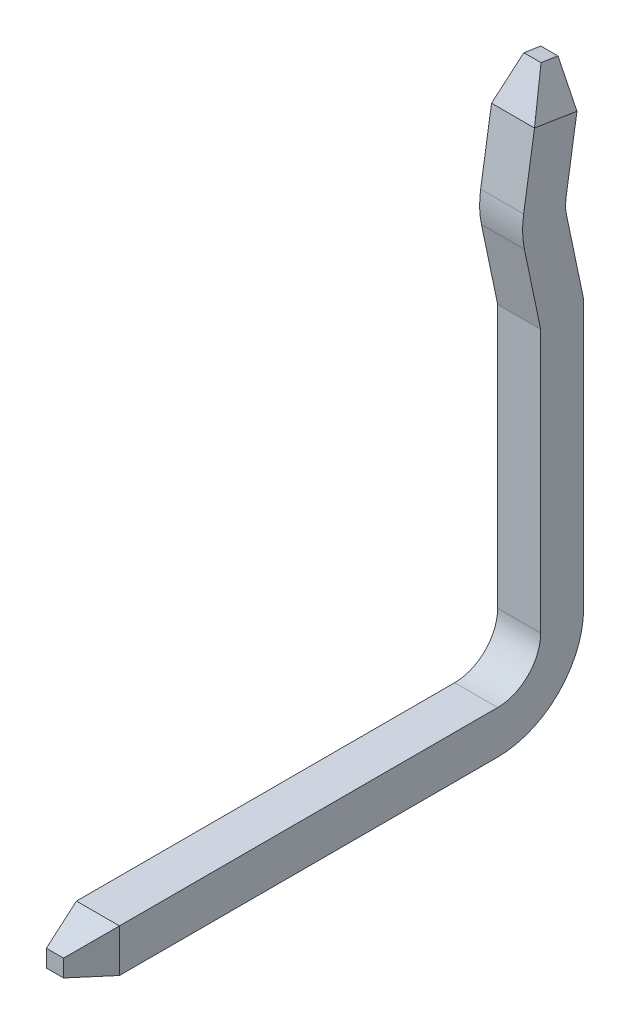
ISO-10303-21;
HEADER;
FILE_DESCRIPTION(('STEP AP214'),'2;1');
FILE_NAME('part.step','',(''),(''),'','','');
FILE_SCHEMA(('AUTOMOTIVE_DESIGN { 1 0 10303 214 1 1 1 1 }'));
ENDSEC;
DATA;
#1=APPLICATION_CONTEXT('core data for automotive mechanical design processes');
#2=APPLICATION_PROTOCOL_DEFINITION('international standard','automotive_design',2000,#1);
#3=PRODUCT_CONTEXT('',#1,'mechanical');
#4=PRODUCT('Part','Part','',(#3));
#5=PRODUCT_RELATED_PRODUCT_CATEGORY('part','',(#4));
#6=PRODUCT_DEFINITION_FORMATION('','',#4);
#7=PRODUCT_DEFINITION_CONTEXT('part definition',#1,'design');
#8=PRODUCT_DEFINITION('design','',#6,#7);
#9=PRODUCT_DEFINITION_SHAPE('','',#8);
#10=(LENGTH_UNIT() NAMED_UNIT(*) SI_UNIT(.MILLI.,.METRE.));
#11=(NAMED_UNIT(*) PLANE_ANGLE_UNIT() SI_UNIT($,.RADIAN.));
#12=(NAMED_UNIT(*) SI_UNIT($,.STERADIAN.) SOLID_ANGLE_UNIT());
#13=UNCERTAINTY_MEASURE_WITH_UNIT(LENGTH_MEASURE(1.E-05),#10,'distance_accuracy_value','');
#14=(GEOMETRIC_REPRESENTATION_CONTEXT(3) GLOBAL_UNCERTAINTY_ASSIGNED_CONTEXT((#13)) GLOBAL_UNIT_ASSIGNED_CONTEXT((#10,
#11,#12)) REPRESENTATION_CONTEXT('',''));
#15=CARTESIAN_POINT('',(0.,0.,0.));
#16=DIRECTION('',(0.,0.,1.));
#17=DIRECTION('',(1.,0.,0.));
#18=AXIS2_PLACEMENT_3D('',#15,#16,#17);
#19=CARTESIAN_POINT('',(0.25,-1.545,1.95));
#20=DIRECTION('',(0.957826285221234,0.,0.28734788556607));
#21=DIRECTION('',(0.28734788556607,0.,-0.957826285221234));
#22=AXIS2_PLACEMENT_3D('',#19,#20,#21);
#23=PLANE('',#22);
#24=DIRECTION('',(-0.276172385369497,-0.276172385369232,0.920574617898403));
#25=VECTOR('',#24,1.);
#26=CARTESIAN_POINT('',(0.25,-2.04500000000014,1.94999999999996));
#27=LINE('',#26,#25);
#28=CARTESIAN_POINT('',(0.25,-2.04500000000004,1.94999999999999));
#29=VERTEX_POINT('',#28);
#30=CARTESIAN_POINT('',(0.1,-2.195,2.45));
#31=VERTEX_POINT('',#30);
#32=EDGE_CURVE('E199',#29,#31,#27,.T.);
#33=ORIENTED_EDGE('',*,*,#32,.T.);
#34=DIRECTION('',(0.,1.,0.));
#35=VECTOR('',#34,1.);
#36=CARTESIAN_POINT('',(0.1,-2.545,2.45));
#37=LINE('',#36,#35);
#38=CARTESIAN_POINT('',(0.1,-2.3950000000001,2.45000000000003));
#39=VERTEX_POINT('',#38);
#40=EDGE_CURVE('E186',#31,#39,#37,.F.);
#41=ORIENTED_EDGE('',*,*,#40,.T.);
#42=DIRECTION('',(0.276172385369497,-0.276172385369232,-0.920574617898403));
#43=VECTOR('',#42,1.);
#44=CARTESIAN_POINT('',(0.1,-2.39500000000014,2.45000000000004));
#45=LINE('',#44,#43);
#46=CARTESIAN_POINT('',(0.25,-2.545,1.95));
#47=VERTEX_POINT('',#46);
#48=EDGE_CURVE('E176',#39,#47,#45,.T.);
#49=ORIENTED_EDGE('',*,*,#48,.T.);
#50=DIRECTION('',(0.,1.,0.));
#51=VECTOR('',#50,1.);
#52=CARTESIAN_POINT('',(0.25,-1.545,1.95));
#53=LINE('',#52,#51);
#54=EDGE_CURVE('E174',#29,#47,#53,.F.);
#55=ORIENTED_EDGE('',*,*,#54,.F.);
#56=EDGE_LOOP('',(#33,#41,#49,#55));
#57=FACE_BOUND('',#56,.T.);
#58=ADVANCED_FACE('F17',(#57),#23,.T.);
#59=CARTESIAN_POINT('',(0.25,3.520833156617,-3.246655096118));
#60=DIRECTION('',(0.957826285221184,0.283859283231054,-0.0446398326939085));
#61=DIRECTION('',(-0.284142531904714,0.95878205112673,0.));
#62=AXIS2_PLACEMENT_3D('',#59,#60,#61);
#63=PLANE('',#62);
#64=DIRECTION('',(-0.276172385369324,0.952301910054694,0.129807109457069));
#65=VECTOR('',#64,1.);
#66=CARTESIAN_POINT('',(0.25,3.50107034627793,-3.37232441069451));
#67=LINE('',#66,#65);
#68=CARTESIAN_POINT('',(0.250000000000004,3.50107034627795,-3.37232441069499));
#69=VERTEX_POINT('',#68);
#70=CARTESIAN_POINT('',(0.1,4.01830267679186,-3.30182110388298));
#71=VERTEX_POINT('',#70);
#72=EDGE_CURVE('E242',#69,#71,#67,.T.);
#73=ORIENTED_EDGE('',*,*,#72,.T.);
#74=DIRECTION('',(0.,-0.155351178610058,-0.987859307444368));
#75=VECTOR('',#74,1.);
#76=CARTESIAN_POINT('',(0.1,4.072675589305,-2.956070346278));
#77=LINE('',#76,#75);
#78=CARTESIAN_POINT('',(0.0999999999999999,4.04937291251366,-3.10424924239441));
#79=VERTEX_POINT('',#78);
#80=EDGE_CURVE('E243',#71,#79,#77,.F.);
#81=ORIENTED_EDGE('',*,*,#80,.T.);
#82=DIRECTION('',(0.276172385369499,-0.866494498921235,0.415831813235302));
#83=VECTOR('',#82,1.);
#84=CARTESIAN_POINT('',(0.0999999999999999,4.04937291251369,-3.10424924239464));
#85=LINE('',#84,#83);
#86=CARTESIAN_POINT('',(0.25,3.57874593558309,-2.87839475697244));
#87=VERTEX_POINT('',#86);
#88=EDGE_CURVE('E203',#79,#87,#85,.T.);
#89=ORIENTED_EDGE('',*,*,#88,.T.);
#90=DIRECTION('',(0.,0.155351178610058,0.987859307444368));
#91=VECTOR('',#90,1.);
#92=CARTESIAN_POINT('',(0.25,3.501070346278,-3.372324410695));
#93=LINE('',#92,#91);
#94=EDGE_CURVE('E156',#69,#87,#93,.T.);
#95=ORIENTED_EDGE('',*,*,#94,.F.);
#96=EDGE_LOOP('',(#73,#81,#89,#95));
#97=FACE_BOUND('',#96,.T.);
#98=ADVANCED_FACE('F443',(#97),#63,.T.);
#99=CARTESIAN_POINT('',(0.25,4.072675589305,-2.956070346278));
#100=DIRECTION('',(0.,-0.987859307444368,0.155351178610058));
#101=DIRECTION('',(0.,-0.155351178610058,-0.987859307444368));
#102=AXIS2_PLACEMENT_3D('',#99,#100,#101);
#103=PLANE('',#102);
#104=DIRECTION('',(-1.25767452008241E-13,0.155351178609941,0.987859307444386));
#105=VECTOR('',#104,1.);
#106=CARTESIAN_POINT('',(-0.0999999999998522,4.01830267679196,-3.30182110388299));
#107=LINE('',#106,#105);
#108=CARTESIAN_POINT('',(-0.0999999999998522,4.01830267679197,-3.301821103883));
#109=VERTEX_POINT('',#108);
#110=CARTESIAN_POINT('',(-0.0999999999998774,4.04937291251387,-3.10424924239421));
#111=VERTEX_POINT('',#110);
#112=EDGE_CURVE('E246',#109,#111,#107,.T.);
#113=ORIENTED_EDGE('',*,*,#112,.T.);
#114=DIRECTION('',(1.,0.,0.));
#115=VECTOR('',#114,1.);
#116=CARTESIAN_POINT('',(0.25,4.04937291251369,-3.10424924239464));
#117=LINE('',#116,#115);
#118=EDGE_CURVE('E236',#111,#79,#117,.T.);
#119=ORIENTED_EDGE('',*,*,#118,.T.);
#120=ORIENTED_EDGE('',*,*,#80,.F.);
#121=DIRECTION('',(1.,0.,0.));
#122=VECTOR('',#121,1.);
#123=CARTESIAN_POINT('',(0.25,4.018302676792,-3.301821103883));
#124=LINE('',#123,#122);
#125=EDGE_CURVE('E239',#71,#109,#124,.F.);
#126=ORIENTED_EDGE('',*,*,#125,.T.);
#127=EDGE_LOOP('',(#113,#119,#120,#126));
#128=FACE_BOUND('',#127,.T.);
#129=ADVANCED_FACE('F424',(#128),#103,.F.);
#130=CARTESIAN_POINT('',(0.25,4.018302676792,-3.301821103883));
#131=DIRECTION('',(0.,-0.135059840918063,0.99083744346446));
#132=DIRECTION('',(0.,-0.99083744346446,-0.135059840918063));
#133=AXIS2_PLACEMENT_3D('',#130,#131,#132);
#134=PLANE('',#133);
#135=DIRECTION('',(1.,0.,0.));
#136=VECTOR('',#135,1.);
#137=CARTESIAN_POINT('',(0.25,3.50107034627796,-3.37232441069522));
#138=LINE('',#137,#136);
#139=CARTESIAN_POINT('',(-0.249999999999963,3.50107034627798,-3.37232441069505));
#140=VERTEX_POINT('',#139);
#141=EDGE_CURVE('E250',#69,#140,#138,.F.);
#142=ORIENTED_EDGE('',*,*,#141,.T.);
#143=DIRECTION('',(0.276172385369322,0.952301910054572,0.129807109457969));
#144=VECTOR('',#143,1.);
#145=CARTESIAN_POINT('',(-0.249999999999852,3.50107034627796,-3.37232441069499));
#146=LINE('',#145,#144);
#147=EDGE_CURVE('E316',#140,#109,#146,.T.);
#148=ORIENTED_EDGE('',*,*,#147,.T.);
#149=ORIENTED_EDGE('',*,*,#125,.F.);
#150=ORIENTED_EDGE('',*,*,#72,.F.);
#151=EDGE_LOOP('',(#142,#148,#149,#150));
#152=FACE_BOUND('',#151,.T.);
#153=ADVANCED_FACE('F427',(#152),#134,.F.);
#154=CARTESIAN_POINT('',(0.25,3.578745935583,-2.878394756973));
#155=DIRECTION('',(0.,-0.432658725543893,-0.901557778076777));
#156=DIRECTION('',(0.,0.901557778076777,-0.432658725543893));
#157=AXIS2_PLACEMENT_3D('',#154,#155,#156);
#158=PLANE('',#157);
#159=ORIENTED_EDGE('',*,*,#118,.F.);
#160=DIRECTION('',(-0.276172385369527,-0.866494498921794,0.415831813234119));
#161=VECTOR('',#160,1.);
#162=CARTESIAN_POINT('',(-0.0999999999998774,4.04937291251396,-3.10424924239399));
#163=LINE('',#162,#161);
#164=CARTESIAN_POINT('',(-0.249999999999973,3.57874593558302,-2.87839475697281));
#165=VERTEX_POINT('',#164);
#166=EDGE_CURVE('E249',#111,#165,#163,.T.);
#167=ORIENTED_EDGE('',*,*,#166,.T.);
#168=DIRECTION('',(1.,0.,0.));
#169=VECTOR('',#168,1.);
#170=CARTESIAN_POINT('',(0.25,3.57874593558312,-2.87839475697225));
#171=LINE('',#170,#169);
#172=EDGE_CURVE('E228',#165,#87,#171,.T.);
#173=ORIENTED_EDGE('',*,*,#172,.T.);
#174=ORIENTED_EDGE('',*,*,#88,.F.);
#175=EDGE_LOOP('',(#159,#167,#173,#174));
#176=FACE_BOUND('',#175,.T.);
#177=ADVANCED_FACE('F420',(#176),#158,.F.);
#178=CARTESIAN_POINT('',(0.25,-2.195,2.45));
#179=DIRECTION('',(0.,-0.957826285221234,-0.28734788556607));
#180=DIRECTION('',(0.,0.28734788556607,-0.957826285221234));
#181=AXIS2_PLACEMENT_3D('',#178,#179,#180);
#182=PLANE('',#181);
#183=DIRECTION('',(1.,0.,0.));
#184=VECTOR('',#183,1.);
#185=CARTESIAN_POINT('',(0.25,-2.045,1.95));
#186=LINE('',#185,#184);
#187=CARTESIAN_POINT('',(-0.249999999999964,-2.045,1.94999999999999));
#188=VERTEX_POINT('',#187);
#189=EDGE_CURVE('E209',#29,#188,#186,.F.);
#190=ORIENTED_EDGE('',*,*,#189,.T.);
#191=DIRECTION('',(0.276172385369232,-0.276172385369497,0.920574617898403));
#192=VECTOR('',#191,1.);
#193=CARTESIAN_POINT('',(-0.249999999999857,-2.045,1.94999999999996));
#194=LINE('',#193,#192);
#195=CARTESIAN_POINT('',(-0.1,-2.195,2.45));
#196=VERTEX_POINT('',#195);
#197=EDGE_CURVE('E193',#188,#196,#194,.T.);
#198=ORIENTED_EDGE('',*,*,#197,.T.);
#199=DIRECTION('',(-1.,0.,0.));
#200=VECTOR('',#199,1.);
#201=CARTESIAN_POINT('',(0.25,-2.195,2.45));
#202=LINE('',#201,#200);
#203=EDGE_CURVE('E196',#196,#31,#202,.F.);
#204=ORIENTED_EDGE('',*,*,#203,.T.);
#205=ORIENTED_EDGE('',*,*,#32,.F.);
#206=EDGE_LOOP('',(#190,#198,#204,#205));
#207=FACE_BOUND('',#206,.T.);
#208=ADVANCED_FACE('F500',(#207),#182,.F.);
#209=CARTESIAN_POINT('',(0.25,-2.545,2.45));
#210=DIRECTION('',(0.,0.,-1.));
#211=DIRECTION('',(-1.,0.,0.));
#212=AXIS2_PLACEMENT_3D('',#209,#210,#211);
#213=PLANE('',#212);
#214=ORIENTED_EDGE('',*,*,#203,.F.);
#215=DIRECTION('',(0.,1.,0.));
#216=VECTOR('',#215,1.);
#217=CARTESIAN_POINT('',(-0.1,-2.545,2.45));
#218=LINE('',#217,#216);
#219=CARTESIAN_POINT('',(-0.1,-2.39500000000005,2.45000000000001));
#220=VERTEX_POINT('',#219);
#221=EDGE_CURVE('E189',#196,#220,#218,.F.);
#222=ORIENTED_EDGE('',*,*,#221,.T.);
#223=DIRECTION('',(1.,0.,0.));
#224=VECTOR('',#223,1.);
#225=CARTESIAN_POINT('',(0.25,-2.39500000000014,2.45000000000004));
#226=LINE('',#225,#224);
#227=EDGE_CURVE('E181',#220,#39,#226,.T.);
#228=ORIENTED_EDGE('',*,*,#227,.T.);
#229=ORIENTED_EDGE('',*,*,#40,.F.);
#230=EDGE_LOOP('',(#214,#222,#228,#229));
#231=FACE_BOUND('',#230,.T.);
#232=ADVANCED_FACE('F496',(#231),#213,.F.);
#233=CARTESIAN_POINT('',(0.25,-2.545,1.95));
#234=DIRECTION('',(0.,0.957826285221234,-0.28734788556607));
#235=DIRECTION('',(0.,0.28734788556607,0.957826285221234));
#236=AXIS2_PLACEMENT_3D('',#233,#234,#235);
#237=PLANE('',#236);
#238=DIRECTION('',(1.,0.,0.));
#239=VECTOR('',#238,1.);
#240=CARTESIAN_POINT('',(0.25,-2.545,1.95));
#241=LINE('',#240,#239);
#242=CARTESIAN_POINT('',(-0.249999999999964,-2.545,1.94999999999999));
#243=VERTEX_POINT('',#242);
#244=EDGE_CURVE('E34',#243,#47,#241,.T.);
#245=ORIENTED_EDGE('',*,*,#244,.T.);
#246=ORIENTED_EDGE('',*,*,#48,.F.);
#247=ORIENTED_EDGE('',*,*,#227,.F.);
#248=DIRECTION('',(-0.276172385369232,-0.276172385369497,-0.920574617898403));
#249=VECTOR('',#248,1.);
#250=CARTESIAN_POINT('',(-0.1,-2.395,2.45));
#251=LINE('',#250,#249);
#252=EDGE_CURVE('E192',#220,#243,#251,.T.);
#253=ORIENTED_EDGE('',*,*,#252,.T.);
#254=EDGE_LOOP('',(#245,#246,#247,#253));
#255=FACE_BOUND('',#254,.T.);
#256=ADVANCED_FACE('F493',(#255),#237,.F.);
#257=CARTESIAN_POINT('',(0.25,-1.545,-2.45));
#258=DIRECTION('',(1.,0.,0.));
#259=DIRECTION('',(0.,0.,-1.));
#260=AXIS2_PLACEMENT_3D('',#257,#258,#259);
#261=PLANE('',#260);
#262=DIRECTION('',(0.,1.,0.));
#263=VECTOR('',#262,1.);
#264=CARTESIAN_POINT('',(0.25,-1.545,-2.95));
#265=LINE('',#264,#263);
#266=CARTESIAN_POINT('',(0.25,1.515153425531,-2.95));
#267=VERTEX_POINT('',#266);
#268=CARTESIAN_POINT('',(0.25,-1.545,-2.95));
#269=VERTEX_POINT('',#268);
#270=EDGE_CURVE('E213',#267,#269,#265,.F.);
#271=ORIENTED_EDGE('',*,*,#270,.T.);
#272=CARTESIAN_POINT('',(0.25,-1.545,-2.45));
#273=DIRECTION('',(1.,0.,0.));
#274=DIRECTION('',(0.,0.,-1.));
#275=AXIS2_PLACEMENT_3D('',#272,#273,#274);
#276=CIRCLE('',#275,0.5);
#277=CARTESIAN_POINT('',(0.25,-2.045,-2.45));
#278=VERTEX_POINT('',#277);
#279=EDGE_CURVE('E297',#269,#278,#276,.F.);
#280=ORIENTED_EDGE('',*,*,#279,.T.);
#281=DIRECTION('',(0.,0.,-1.));
#282=VECTOR('',#281,1.);
#283=CARTESIAN_POINT('',(0.25,-2.045,2.45));
#284=LINE('',#283,#282);
#285=EDGE_CURVE('E206',#278,#29,#284,.F.);
#286=ORIENTED_EDGE('',*,*,#285,.T.);
#287=ORIENTED_EDGE('',*,*,#54,.T.);
#288=DIRECTION('',(0.,0.,1.));
#289=VECTOR('',#288,1.);
#290=CARTESIAN_POINT('',(0.25,-2.545,2.45));
#291=LINE('',#290,#289);
#292=CARTESIAN_POINT('',(0.25,-2.545,-2.45));
#293=VERTEX_POINT('',#292);
#294=EDGE_CURVE('E150',#47,#293,#291,.F.);
#295=ORIENTED_EDGE('',*,*,#294,.T.);
#296=CARTESIAN_POINT('',(0.25,-1.545,-2.45));
#297=DIRECTION('',(1.,0.,0.));
#298=DIRECTION('',(0.,0.,-1.));
#299=AXIS2_PLACEMENT_3D('',#296,#297,#298);
#300=CIRCLE('',#299,1.);
#301=CARTESIAN_POINT('',(0.25,-1.545,-3.45));
#302=VERTEX_POINT('',#301);
#303=EDGE_CURVE('E20',#302,#293,#300,.F.);
#304=ORIENTED_EDGE('',*,*,#303,.F.);
#305=DIRECTION('',(0.,1.,0.));
#306=VECTOR('',#305,1.);
#307=CARTESIAN_POINT('',(0.25,-1.545,-3.45));
#308=LINE('',#307,#306);
#309=CARTESIAN_POINT('',(0.25,1.545,-3.45));
#310=VERTEX_POINT('',#309);
#311=EDGE_CURVE('E148',#302,#310,#308,.T.);
#312=ORIENTED_EDGE('',*,*,#311,.T.);
#313=CARTESIAN_POINT('',(0.25,1.545,-3.237819200235));
#314=DIRECTION('',(1.,0.,0.));
#315=DIRECTION('',(0.,0.,-1.));
#316=AXIS2_PLACEMENT_3D('',#313,#314,#315);
#317=CIRCLE('',#316,0.212180799765);
#318=CARTESIAN_POINT('',(0.25,1.58853770772307,-3.44548518154899));
#319=VERTEX_POINT('',#318);
#320=EDGE_CURVE('E162',#319,#310,#317,.F.);
#321=ORIENTED_EDGE('',*,*,#320,.F.);
#322=DIRECTION('',(0.,-0.978721833191562,-0.205191552540908));
#323=VECTOR('',#322,1.);
#324=CARTESIAN_POINT('',(0.25,1.588537707723,-3.445485181549));
#325=LINE('',#324,#323);
#326=CARTESIAN_POINT('',(0.25,2.51788544912486,-3.2506450344903));
#327=VERTEX_POINT('',#326);
#328=EDGE_CURVE('E267',#319,#327,#325,.F.);
#329=ORIENTED_EDGE('',*,*,#328,.T.);
#330=CARTESIAN_POINT('',(0.25,2.62053861345,-3.740279680397));
#331=DIRECTION('',(1.,0.,0.));
#332=DIRECTION('',(0.,0.,-1.));
#333=AXIS2_PLACEMENT_3D('',#330,#331,#332);
#334=CIRCLE('',#333,0.500279680397);
#335=CARTESIAN_POINT('',(0.25,2.69825765143413,-3.24607374179202));
#336=VERTEX_POINT('',#335);
#337=EDGE_CURVE('E301',#327,#336,#334,.F.);
#338=ORIENTED_EDGE('',*,*,#337,.T.);
#339=DIRECTION('',(0.,-0.987859307444368,0.155351178610058));
#340=VECTOR('',#339,1.);
#341=CARTESIAN_POINT('',(0.25,2.698257651434,-3.246073741792));
#342=LINE('',#341,#340);
#343=EDGE_CURVE('E261',#336,#69,#342,.F.);
#344=ORIENTED_EDGE('',*,*,#343,.T.);
#345=ORIENTED_EDGE('',*,*,#94,.T.);
#346=DIRECTION('',(0.,0.987859307444368,-0.155351178610058));
#347=VECTOR('',#346,1.);
#348=CARTESIAN_POINT('',(0.25,2.775933240739,-2.752144088069));
#349=LINE('',#348,#347);
#350=CARTESIAN_POINT('',(0.25,2.77593324073918,-2.75214408806917));
#351=VERTEX_POINT('',#350);
#352=EDGE_CURVE('E224',#87,#351,#349,.F.);
#353=ORIENTED_EDGE('',*,*,#352,.T.);
#354=CARTESIAN_POINT('',(0.25,2.62053861345,-3.740279680397));
#355=DIRECTION('',(1.,0.,0.));
#356=DIRECTION('',(0.,0.,-1.));
#357=AXIS2_PLACEMENT_3D('',#354,#355,#356);
#358=CIRCLE('',#357,1.000279680397);
#359=CARTESIAN_POINT('',(0.25,2.41528967285407,-2.76128411789459));
#360=VERTEX_POINT('',#359);
#361=EDGE_CURVE('E227',#360,#351,#358,.F.);
#362=ORIENTED_EDGE('',*,*,#361,.F.);
#363=DIRECTION('',(0.,0.978721833191562,0.205191552540908));
#364=VECTOR('',#363,1.);
#365=CARTESIAN_POINT('',(0.25,1.515153425531,-2.95));
#366=LINE('',#365,#364);
#367=EDGE_CURVE('E219',#360,#267,#366,.F.);
#368=ORIENTED_EDGE('',*,*,#367,.T.);
#369=EDGE_LOOP('',(#271,#280,#286,#287,#295,#304,#312,#321,#329,#338,#344,#345,#353,#362,#368));
#370=FACE_BOUND('',#369,.T.);
#371=ADVANCED_FACE('F147',(#370),#261,.T.);
#372=CARTESIAN_POINT('',(0.25,-1.545,-2.45));
#373=DIRECTION('',(1.,0.,0.));
#374=DIRECTION('',(0.,0.,-1.));
#375=AXIS2_PLACEMENT_3D('',#372,#373,#374);
#376=CYLINDRICAL_SURFACE('',#375,1.);
#377=ORIENTED_EDGE('',*,*,#303,.T.);
#378=DIRECTION('',(1.,0.,0.));
#379=VECTOR('',#378,1.);
#380=CARTESIAN_POINT('',(0.25,-2.545,-2.45));
#381=LINE('',#380,#379);
#382=CARTESIAN_POINT('',(-0.25,-2.545,-2.45));
#383=VERTEX_POINT('',#382);
#384=EDGE_CURVE('E354',#293,#383,#381,.F.);
#385=ORIENTED_EDGE('',*,*,#384,.T.);
#386=CARTESIAN_POINT('',(-0.25,-1.545,-2.45));
#387=DIRECTION('',(1.,0.,0.));
#388=DIRECTION('',(0.,0.,-1.));
#389=AXIS2_PLACEMENT_3D('',#386,#387,#388);
#390=CIRCLE('',#389,1.);
#391=CARTESIAN_POINT('',(-0.25,-1.545,-3.45));
#392=VERTEX_POINT('',#391);
#393=EDGE_CURVE('E166',#383,#392,#390,.T.);
#394=ORIENTED_EDGE('',*,*,#393,.T.);
#395=DIRECTION('',(1.,0.,0.));
#396=VECTOR('',#395,1.);
#397=CARTESIAN_POINT('',(0.25,-1.545,-3.45));
#398=LINE('',#397,#396);
#399=EDGE_CURVE('E155',#392,#302,#398,.T.);
#400=ORIENTED_EDGE('',*,*,#399,.T.);
#401=EDGE_LOOP('',(#377,#385,#394,#400));
#402=FACE_BOUND('',#401,.T.);
#403=ADVANCED_FACE('F165',(#402),#376,.T.);
#404=CARTESIAN_POINT('',(0.25,-1.545,-3.45));
#405=DIRECTION('',(0.,0.,1.));
#406=DIRECTION('',(1.,0.,0.));
#407=AXIS2_PLACEMENT_3D('',#404,#405,#406);
#408=PLANE('',#407);
#409=DIRECTION('',(1.,0.,0.));
#410=VECTOR('',#409,1.);
#411=CARTESIAN_POINT('',(0.25,1.545,-3.45));
#412=LINE('',#411,#410);
#413=CARTESIAN_POINT('',(-0.25,1.545,-3.45));
#414=VERTEX_POINT('',#413);
#415=EDGE_CURVE('E161',#310,#414,#412,.F.);
#416=ORIENTED_EDGE('',*,*,#415,.F.);
#417=ORIENTED_EDGE('',*,*,#311,.F.);
#418=ORIENTED_EDGE('',*,*,#399,.F.);
#419=DIRECTION('',(0.,1.,0.));
#420=VECTOR('',#419,1.);
#421=CARTESIAN_POINT('',(-0.25,-1.545,-3.45));
#422=LINE('',#421,#420);
#423=EDGE_CURVE('E295',#392,#414,#422,.T.);
#424=ORIENTED_EDGE('',*,*,#423,.T.);
#425=EDGE_LOOP('',(#416,#417,#418,#424));
#426=FACE_BOUND('',#425,.T.);
#427=ADVANCED_FACE('F158',(#426),#408,.F.);
#428=CARTESIAN_POINT('',(0.25,1.545,-3.237819200235));
#429=DIRECTION('',(1.,0.,0.));
#430=DIRECTION('',(0.,0.,-1.));
#431=AXIS2_PLACEMENT_3D('',#428,#429,#430);
#432=CYLINDRICAL_SURFACE('',#431,0.212180799765);
#433=ORIENTED_EDGE('',*,*,#320,.T.);
#434=ORIENTED_EDGE('',*,*,#415,.T.);
#435=CARTESIAN_POINT('',(-0.25,1.545,-3.237819200235));
#436=DIRECTION('',(1.,0.,0.));
#437=DIRECTION('',(0.,0.,-1.));
#438=AXIS2_PLACEMENT_3D('',#435,#436,#437);
#439=CIRCLE('',#438,0.212180799765);
#440=CARTESIAN_POINT('',(-0.25,1.58853770772309,-3.44548518154898));
#441=VERTEX_POINT('',#440);
#442=EDGE_CURVE('E292',#414,#441,#439,.T.);
#443=ORIENTED_EDGE('',*,*,#442,.T.);
#444=DIRECTION('',(1.,0.,0.));
#445=VECTOR('',#444,1.);
#446=CARTESIAN_POINT('',(0.25,1.588537707723,-3.445485181549));
#447=LINE('',#446,#445);
#448=EDGE_CURVE('E269',#441,#319,#447,.T.);
#449=ORIENTED_EDGE('',*,*,#448,.T.);
#450=EDGE_LOOP('',(#433,#434,#443,#449));
#451=FACE_BOUND('',#450,.T.);
#452=ADVANCED_FACE('F484',(#451),#432,.T.);
#453=CARTESIAN_POINT('',(0.25,1.588537707723,-3.445485181549));
#454=DIRECTION('',(0.,-0.205191552540908,0.978721833191562));
#455=DIRECTION('',(0.,-0.978721833191562,-0.205191552540908));
#456=AXIS2_PLACEMENT_3D('',#453,#454,#455);
#457=PLANE('',#456);
#458=DIRECTION('',(1.,0.,0.));
#459=VECTOR('',#458,1.);
#460=CARTESIAN_POINT('',(0.25,2.51788544912506,-3.25064503449028));
#461=LINE('',#460,#459);
#462=CARTESIAN_POINT('',(-0.25,2.51788544912477,-3.25064503449019));
#463=VERTEX_POINT('',#462);
#464=EDGE_CURVE('E268',#463,#327,#461,.T.);
#465=ORIENTED_EDGE('',*,*,#464,.T.);
#466=ORIENTED_EDGE('',*,*,#328,.F.);
#467=ORIENTED_EDGE('',*,*,#448,.F.);
#468=DIRECTION('',(0.,0.978721833191511,0.205191552541151));
#469=VECTOR('',#468,1.);
#470=CARTESIAN_POINT('',(-0.25,1.588537707723,-3.445485181549));
#471=LINE('',#470,#469);
#472=EDGE_CURVE('E291',#441,#463,#471,.T.);
#473=ORIENTED_EDGE('',*,*,#472,.T.);
#474=EDGE_LOOP('',(#465,#466,#467,#473));
#475=FACE_BOUND('',#474,.T.);
#476=ADVANCED_FACE('F440',(#475),#457,.F.);
#477=CARTESIAN_POINT('',(0.25,2.62053861345,-3.740279680397));
#478=DIRECTION('',(1.,0.,0.));
#479=DIRECTION('',(0.,0.,-1.));
#480=AXIS2_PLACEMENT_3D('',#477,#478,#479);
#481=CYLINDRICAL_SURFACE('',#480,0.500279680397);
#482=DIRECTION('',(1.,0.,0.));
#483=VECTOR('',#482,1.);
#484=CARTESIAN_POINT('',(0.25,2.698257651434,-3.246073741792));
#485=LINE('',#484,#483);
#486=CARTESIAN_POINT('',(-0.25,2.69825765143406,-3.24607374179201));
#487=VERTEX_POINT('',#486);
#488=EDGE_CURVE('E264',#487,#336,#485,.T.);
#489=ORIENTED_EDGE('',*,*,#488,.T.);
#490=ORIENTED_EDGE('',*,*,#337,.F.);
#491=ORIENTED_EDGE('',*,*,#464,.F.);
#492=CARTESIAN_POINT('',(-0.25,2.62053861345,-3.740279680397));
#493=DIRECTION('',(1.,0.,0.));
#494=DIRECTION('',(0.,0.,-1.));
#495=AXIS2_PLACEMENT_3D('',#492,#493,#494);
#496=CIRCLE('',#495,0.500279680397);
#497=EDGE_CURVE('E287',#463,#487,#496,.F.);
#498=ORIENTED_EDGE('',*,*,#497,.T.);
#499=EDGE_LOOP('',(#489,#490,#491,#498));
#500=FACE_BOUND('',#499,.T.);
#501=ADVANCED_FACE('F437',(#500),#481,.F.);
#502=CARTESIAN_POINT('',(0.25,2.698257651434,-3.246073741792));
#503=DIRECTION('',(0.,0.155351178610058,0.987859307444368));
#504=DIRECTION('',(0.,-0.987859307444368,0.155351178610058));
#505=AXIS2_PLACEMENT_3D('',#502,#503,#504);
#506=PLANE('',#505);
#507=ORIENTED_EDGE('',*,*,#141,.F.);
#508=ORIENTED_EDGE('',*,*,#343,.F.);
#509=ORIENTED_EDGE('',*,*,#488,.F.);
#510=DIRECTION('',(0.,0.987859307444411,-0.155351178609783));
#511=VECTOR('',#510,1.);
#512=CARTESIAN_POINT('',(-0.25,2.698257651434,-3.246073741792));
#513=LINE('',#512,#511);
#514=EDGE_CURVE('E290',#487,#140,#513,.T.);
#515=ORIENTED_EDGE('',*,*,#514,.T.);
#516=EDGE_LOOP('',(#507,#508,#509,#515));
#517=FACE_BOUND('',#516,.T.);
#518=ADVANCED_FACE('F434',(#517),#506,.F.);
#519=CARTESIAN_POINT('',(-0.1,4.072675589305,-2.956070346278));
#520=DIRECTION('',(0.957826285221184,-0.283859283231054,0.0446398326939086));
#521=DIRECTION('',(0.284142531904714,0.95878205112673,0.));
#522=AXIS2_PLACEMENT_3D('',#519,#520,#521);
#523=PLANE('',#522);
#524=DIRECTION('',(0.,0.155351178610058,0.987859307444368));
#525=VECTOR('',#524,1.);
#526=CARTESIAN_POINT('',(-0.25,3.501070346278,-3.372324410695));
#527=LINE('',#526,#525);
#528=EDGE_CURVE('E325',#140,#165,#527,.T.);
#529=ORIENTED_EDGE('',*,*,#528,.T.);
#530=ORIENTED_EDGE('',*,*,#166,.F.);
#531=ORIENTED_EDGE('',*,*,#112,.F.);
#532=ORIENTED_EDGE('',*,*,#147,.F.);
#533=EDGE_LOOP('',(#529,#530,#531,#532));
#534=FACE_BOUND('',#533,.T.);
#535=ADVANCED_FACE('F422',(#534),#523,.F.);
#536=CARTESIAN_POINT('',(0.25,2.775933240739,-2.752144088069));
#537=DIRECTION('',(0.,-0.155351178610058,-0.987859307444368));
#538=DIRECTION('',(0.,0.987859307444368,-0.155351178610058));
#539=AXIS2_PLACEMENT_3D('',#536,#537,#538);
#540=PLANE('',#539);
#541=ORIENTED_EDGE('',*,*,#172,.F.);
#542=DIRECTION('',(0.,-0.987859307444222,0.155351178610984));
#543=VECTOR('',#542,1.);
#544=CARTESIAN_POINT('',(-0.25,3.578745935583,-2.878394756973));
#545=LINE('',#544,#543);
#546=CARTESIAN_POINT('',(-0.25,2.77593324073965,-2.75214408806925));
#547=VERTEX_POINT('',#546);
#548=EDGE_CURVE('E286',#165,#547,#545,.T.);
#549=ORIENTED_EDGE('',*,*,#548,.T.);
#550=DIRECTION('',(1.,0.,0.));
#551=VECTOR('',#550,1.);
#552=CARTESIAN_POINT('',(0.25,2.77593324073896,-2.75214408806928));
#553=LINE('',#552,#551);
#554=EDGE_CURVE('E300',#351,#547,#553,.F.);
#555=ORIENTED_EDGE('',*,*,#554,.F.);
#556=ORIENTED_EDGE('',*,*,#352,.F.);
#557=EDGE_LOOP('',(#541,#549,#555,#556));
#558=FACE_BOUND('',#557,.T.);
#559=ADVANCED_FACE('F415',(#558),#540,.F.);
#560=CARTESIAN_POINT('',(0.25,2.62053861345,-3.740279680397));
#561=DIRECTION('',(1.,0.,0.));
#562=DIRECTION('',(0.,0.,-1.));
#563=AXIS2_PLACEMENT_3D('',#560,#561,#562);
#564=CYLINDRICAL_SURFACE('',#563,1.000279680397);
#565=ORIENTED_EDGE('',*,*,#361,.T.);
#566=ORIENTED_EDGE('',*,*,#554,.T.);
#567=CARTESIAN_POINT('',(-0.25,2.62053861345,-3.740279680397));
#568=DIRECTION('',(1.,0.,0.));
#569=DIRECTION('',(0.,0.,-1.));
#570=AXIS2_PLACEMENT_3D('',#567,#568,#569);
#571=CIRCLE('',#570,1.000279680397);
#572=CARTESIAN_POINT('',(-0.25,2.41528967285431,-2.76128411789474));
#573=VERTEX_POINT('',#572);
#574=EDGE_CURVE('E282',#547,#573,#571,.T.);
#575=ORIENTED_EDGE('',*,*,#574,.T.);
#576=DIRECTION('',(1.,0.,0.));
#577=VECTOR('',#576,1.);
#578=CARTESIAN_POINT('',(0.25,2.41528967285392,-2.76128411789462));
#579=LINE('',#578,#577);
#580=EDGE_CURVE('E221',#573,#360,#579,.T.);
#581=ORIENTED_EDGE('',*,*,#580,.T.);
#582=EDGE_LOOP('',(#565,#566,#575,#581));
#583=FACE_BOUND('',#582,.T.);
#584=ADVANCED_FACE('F410',(#583),#564,.T.);
#585=CARTESIAN_POINT('',(0.25,1.515153425531,-2.95));
#586=DIRECTION('',(0.,0.205191552540908,-0.978721833191562));
#587=DIRECTION('',(0.,0.978721833191562,0.205191552540908));
#588=AXIS2_PLACEMENT_3D('',#585,#586,#587);
#589=PLANE('',#588);
#590=DIRECTION('',(1.,0.,0.));
#591=VECTOR('',#590,1.);
#592=CARTESIAN_POINT('',(0.25,1.515153425531,-2.95));
#593=LINE('',#592,#591);
#594=CARTESIAN_POINT('',(-0.25,1.515153425531,-2.95));
#595=VERTEX_POINT('',#594);
#596=EDGE_CURVE('E216',#595,#267,#593,.T.);
#597=ORIENTED_EDGE('',*,*,#596,.T.);
#598=ORIENTED_EDGE('',*,*,#367,.F.);
#599=ORIENTED_EDGE('',*,*,#580,.F.);
#600=DIRECTION('',(0.,-0.978721833191648,-0.205191552540499));
#601=VECTOR('',#600,1.);
#602=CARTESIAN_POINT('',(-0.25,2.415289672854,-2.761284117895));
#603=LINE('',#602,#601);
#604=EDGE_CURVE('E285',#573,#595,#603,.T.);
#605=ORIENTED_EDGE('',*,*,#604,.T.);
#606=EDGE_LOOP('',(#597,#598,#599,#605));
#607=FACE_BOUND('',#606,.T.);
#608=ADVANCED_FACE('F407',(#607),#589,.F.);
#609=CARTESIAN_POINT('',(0.25,-1.545,-2.95));
#610=DIRECTION('',(0.,0.,-1.));
#611=DIRECTION('',(0.,1.,0.));
#612=AXIS2_PLACEMENT_3D('',#609,#610,#611);
#613=PLANE('',#612);
#614=DIRECTION('',(1.,0.,0.));
#615=VECTOR('',#614,1.);
#616=CARTESIAN_POINT('',(0.25,-1.545,-2.95));
#617=LINE('',#616,#615);
#618=CARTESIAN_POINT('',(-0.25,-1.545,-2.95));
#619=VERTEX_POINT('',#618);
#620=EDGE_CURVE('E215',#619,#269,#617,.T.);
#621=ORIENTED_EDGE('',*,*,#620,.T.);
#622=ORIENTED_EDGE('',*,*,#270,.F.);
#623=ORIENTED_EDGE('',*,*,#596,.F.);
#624=DIRECTION('',(0.,1.,0.));
#625=VECTOR('',#624,1.);
#626=CARTESIAN_POINT('',(-0.25,-1.545,-2.95));
#627=LINE('',#626,#625);
#628=EDGE_CURVE('E281',#595,#619,#627,.F.);
#629=ORIENTED_EDGE('',*,*,#628,.T.);
#630=EDGE_LOOP('',(#621,#622,#623,#629));
#631=FACE_BOUND('',#630,.T.);
#632=ADVANCED_FACE('F403',(#631),#613,.F.);
#633=CARTESIAN_POINT('',(0.25,-1.545,-2.45));
#634=DIRECTION('',(1.,0.,0.));
#635=DIRECTION('',(0.,0.,-1.));
#636=AXIS2_PLACEMENT_3D('',#633,#634,#635);
#637=CYLINDRICAL_SURFACE('',#636,0.5);
#638=DIRECTION('',(1.,0.,0.));
#639=VECTOR('',#638,1.);
#640=CARTESIAN_POINT('',(0.25,-2.045,-2.45));
#641=LINE('',#640,#639);
#642=CARTESIAN_POINT('',(-0.25,-2.045,-2.45));
#643=VERTEX_POINT('',#642);
#644=EDGE_CURVE('E210',#643,#278,#641,.T.);
#645=ORIENTED_EDGE('',*,*,#644,.T.);
#646=ORIENTED_EDGE('',*,*,#279,.F.);
#647=ORIENTED_EDGE('',*,*,#620,.F.);
#648=CARTESIAN_POINT('',(-0.25,-1.545,-2.45));
#649=DIRECTION('',(1.,0.,0.));
#650=DIRECTION('',(0.,0.,-1.));
#651=AXIS2_PLACEMENT_3D('',#648,#649,#650);
#652=CIRCLE('',#651,0.5);
#653=EDGE_CURVE('E277',#619,#643,#652,.F.);
#654=ORIENTED_EDGE('',*,*,#653,.T.);
#655=EDGE_LOOP('',(#645,#646,#647,#654));
#656=FACE_BOUND('',#655,.T.);
#657=ADVANCED_FACE('F399',(#656),#637,.F.);
#658=CARTESIAN_POINT('',(0.25,-2.045,2.45));
#659=DIRECTION('',(0.,-1.,0.));
#660=DIRECTION('',(0.,0.,-1.));
#661=AXIS2_PLACEMENT_3D('',#658,#659,#660);
#662=PLANE('',#661);
#663=ORIENTED_EDGE('',*,*,#189,.F.);
#664=ORIENTED_EDGE('',*,*,#285,.F.);
#665=ORIENTED_EDGE('',*,*,#644,.F.);
#666=DIRECTION('',(0.,0.,-1.));
#667=VECTOR('',#666,1.);
#668=CARTESIAN_POINT('',(-0.25,-2.045,-2.45));
#669=LINE('',#668,#667);
#670=EDGE_CURVE('E280',#643,#188,#669,.F.);
#671=ORIENTED_EDGE('',*,*,#670,.T.);
#672=EDGE_LOOP('',(#663,#664,#665,#671));
#673=FACE_BOUND('',#672,.T.);
#674=ADVANCED_FACE('F390',(#673),#662,.F.);
#675=CARTESIAN_POINT('',(-0.1,-2.545,2.45));
#676=DIRECTION('',(0.957826285221234,0.,-0.28734788556607));
#677=DIRECTION('',(-0.28734788556607,0.,-0.957826285221234));
#678=AXIS2_PLACEMENT_3D('',#675,#676,#677);
#679=PLANE('',#678);
#680=ORIENTED_EDGE('',*,*,#221,.F.);
#681=ORIENTED_EDGE('',*,*,#197,.F.);
#682=DIRECTION('',(0.,1.,0.));
#683=VECTOR('',#682,1.);
#684=CARTESIAN_POINT('',(-0.25,-1.545,1.95));
#685=LINE('',#684,#683);
#686=EDGE_CURVE('E26',#188,#243,#685,.F.);
#687=ORIENTED_EDGE('',*,*,#686,.T.);
#688=ORIENTED_EDGE('',*,*,#252,.F.);
#689=EDGE_LOOP('',(#680,#681,#687,#688));
#690=FACE_BOUND('',#689,.T.);
#691=ADVANCED_FACE('F458',(#690),#679,.F.);
#692=CARTESIAN_POINT('',(0.25,-2.545,2.45));
#693=DIRECTION('',(0.,1.,0.));
#694=DIRECTION('',(0.,0.,1.));
#695=AXIS2_PLACEMENT_3D('',#692,#693,#694);
#696=PLANE('',#695);
#697=ORIENTED_EDGE('',*,*,#244,.F.);
#698=DIRECTION('',(0.,0.,-1.));
#699=VECTOR('',#698,1.);
#700=CARTESIAN_POINT('',(-0.25,-2.545,-2.45));
#701=LINE('',#700,#699);
#702=EDGE_CURVE('E11',#243,#383,#701,.T.);
#703=ORIENTED_EDGE('',*,*,#702,.T.);
#704=ORIENTED_EDGE('',*,*,#384,.F.);
#705=ORIENTED_EDGE('',*,*,#294,.F.);
#706=EDGE_LOOP('',(#697,#703,#704,#705));
#707=FACE_BOUND('',#706,.T.);
#708=ADVANCED_FACE('F453',(#707),#696,.F.);
#709=CARTESIAN_POINT('',(-0.25,-1.545,-2.45));
#710=DIRECTION('',(1.,0.,0.));
#711=DIRECTION('',(0.,0.,-1.));
#712=AXIS2_PLACEMENT_3D('',#709,#710,#711);
#713=PLANE('',#712);
#714=ORIENTED_EDGE('',*,*,#686,.F.);
#715=ORIENTED_EDGE('',*,*,#670,.F.);
#716=ORIENTED_EDGE('',*,*,#653,.F.);
#717=ORIENTED_EDGE('',*,*,#628,.F.);
#718=ORIENTED_EDGE('',*,*,#604,.F.);
#719=ORIENTED_EDGE('',*,*,#574,.F.);
#720=ORIENTED_EDGE('',*,*,#548,.F.);
#721=ORIENTED_EDGE('',*,*,#528,.F.);
#722=ORIENTED_EDGE('',*,*,#514,.F.);
#723=ORIENTED_EDGE('',*,*,#497,.F.);
#724=ORIENTED_EDGE('',*,*,#472,.F.);
#725=ORIENTED_EDGE('',*,*,#442,.F.);
#726=ORIENTED_EDGE('',*,*,#423,.F.);
#727=ORIENTED_EDGE('',*,*,#393,.F.);
#728=ORIENTED_EDGE('',*,*,#702,.F.);
#729=EDGE_LOOP('',(#714,#715,#716,#717,#718,#719,#720,#721,#722,#723,#724,#725,#726,#727,#728));
#730=FACE_BOUND('',#729,.T.);
#731=ADVANCED_FACE('F395',(#730),#713,.F.);
#732=CLOSED_SHELL('',(#58,#98,#129,#153,#177,#208,#232,#256,#371,#403,#427,#452,#476,#501,#518,
#535,#559,#584,#608,#632,#657,#674,#691,#708,#731));
#733=MANIFOLD_SOLID_BREP('B1',#732);
#734=ADVANCED_BREP_SHAPE_REPRESENTATION('',(#18,#733),#14);
#735=SHAPE_DEFINITION_REPRESENTATION(#9,#734);
ENDSEC;
END-ISO-10303-21;
